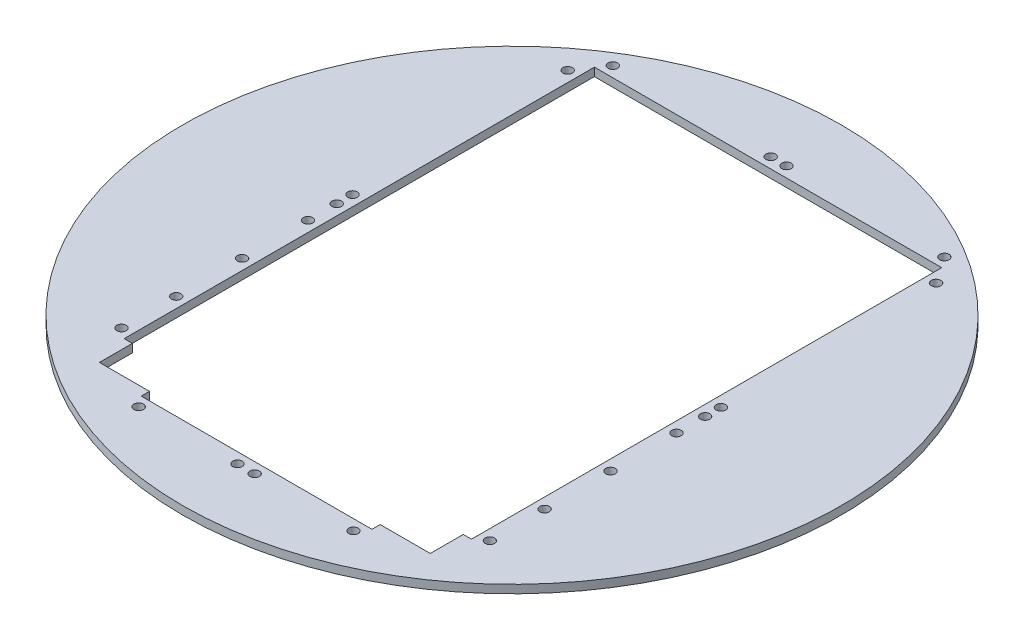
ISO-10303-21;
HEADER;
FILE_DESCRIPTION(('STEP AP214'),'2;1');
FILE_NAME('part.step','',(''),(''),'','','');
FILE_SCHEMA(('AUTOMOTIVE_DESIGN { 1 0 10303 214 1 1 1 1 }'));
ENDSEC;
DATA;
#1=APPLICATION_CONTEXT('core data for automotive mechanical design processes');
#2=APPLICATION_PROTOCOL_DEFINITION('international standard','automotive_design',2000,#1);
#3=PRODUCT_CONTEXT('',#1,'mechanical');
#4=PRODUCT('Part','Part','',(#3));
#5=PRODUCT_RELATED_PRODUCT_CATEGORY('part','',(#4));
#6=PRODUCT_DEFINITION_FORMATION('','',#4);
#7=PRODUCT_DEFINITION_CONTEXT('part definition',#1,'design');
#8=PRODUCT_DEFINITION('design','',#6,#7);
#9=PRODUCT_DEFINITION_SHAPE('','',#8);
#10=(LENGTH_UNIT() NAMED_UNIT(*) SI_UNIT(.MILLI.,.METRE.));
#11=(NAMED_UNIT(*) PLANE_ANGLE_UNIT() SI_UNIT($,.RADIAN.));
#12=(NAMED_UNIT(*) SI_UNIT($,.STERADIAN.) SOLID_ANGLE_UNIT());
#13=UNCERTAINTY_MEASURE_WITH_UNIT(LENGTH_MEASURE(1.E-05),#10,'distance_accuracy_value','');
#14=(GEOMETRIC_REPRESENTATION_CONTEXT(3) GLOBAL_UNCERTAINTY_ASSIGNED_CONTEXT((#13)) GLOBAL_UNIT_ASSIGNED_CONTEXT((#10,
#11,#12)) REPRESENTATION_CONTEXT('',''));
#15=CARTESIAN_POINT('',(0.,0.,0.));
#16=DIRECTION('',(0.,0.,1.));
#17=DIRECTION('',(1.,0.,0.));
#18=AXIS2_PLACEMENT_3D('',#15,#16,#17);
#19=CARTESIAN_POINT('',(63.5,0.,95.25));
#20=DIRECTION('',(0.,0.,1.));
#21=DIRECTION('',(1.,0.,0.));
#22=AXIS2_PLACEMENT_3D('',#19,#20,#21);
#23=PLANE('',#22);
#24=DIRECTION('',(1.,0.,0.));
#25=VECTOR('',#24,1.);
#26=CARTESIAN_POINT('',(63.5,0.,95.25));
#27=LINE('',#26,#25);
#28=CARTESIAN_POINT('',(44.4500000000001,0.,95.25));
#29=VERTEX_POINT('',#28);
#30=CARTESIAN_POINT('',(63.754,0.,95.25));
#31=VERTEX_POINT('',#30);
#32=EDGE_CURVE('E293',#29,#31,#27,.T.);
#33=ORIENTED_EDGE('',*,*,#32,.F.);
#34=DIRECTION('',(0.,-1.,0.));
#35=VECTOR('',#34,1.);
#36=CARTESIAN_POINT('',(44.4500000000001,3.175,95.25));
#37=LINE('',#36,#35);
#38=CARTESIAN_POINT('',(44.4500000000001,3.175,95.25));
#39=VERTEX_POINT('',#38);
#40=EDGE_CURVE('E259',#39,#29,#37,.T.);
#41=ORIENTED_EDGE('',*,*,#40,.F.);
#42=DIRECTION('',(1.,0.,0.));
#43=VECTOR('',#42,1.);
#44=CARTESIAN_POINT('',(63.5,3.175,95.25));
#45=LINE('',#44,#43);
#46=CARTESIAN_POINT('',(63.754,3.175,95.25));
#47=VERTEX_POINT('',#46);
#48=EDGE_CURVE('E289',#39,#47,#45,.T.);
#49=ORIENTED_EDGE('',*,*,#48,.T.);
#50=DIRECTION('',(0.,-1.,0.));
#51=VECTOR('',#50,1.);
#52=CARTESIAN_POINT('',(63.754,3.175,95.25));
#53=LINE('',#52,#51);
#54=EDGE_CURVE('E235',#47,#31,#53,.T.);
#55=ORIENTED_EDGE('',*,*,#54,.T.);
#56=EDGE_LOOP('',(#33,#41,#49,#55));
#57=FACE_BOUND('',#56,.T.);
#58=ADVANCED_FACE('F32',(#57),#23,.F.);
#59=CARTESIAN_POINT('',(0.,3.175,0.));
#60=DIRECTION('',(0.,-1.,0.));
#61=DIRECTION('',(0.,0.,-1.));
#62=AXIS2_PLACEMENT_3D('',#59,#60,#61);
#63=CYLINDRICAL_SURFACE('',#62,127.);
#64=CARTESIAN_POINT('',(0.,3.175,0.));
#65=DIRECTION('',(0.,1.,0.));
#66=DIRECTION('',(0.,0.,1.));
#67=AXIS2_PLACEMENT_3D('',#64,#65,#66);
#68=CIRCLE('',#67,127.);
#69=CARTESIAN_POINT('',(0.,3.175,127.));
#70=VERTEX_POINT('',#69);
#71=EDGE_CURVE('E11',#70,#70,#68,.T.);
#72=ORIENTED_EDGE('',*,*,#71,.F.);
#73=EDGE_LOOP('',(#72));
#74=FACE_BOUND('',#73,.T.);
#75=CARTESIAN_POINT('',(0.,0.,0.));
#76=DIRECTION('',(0.,1.,0.));
#77=DIRECTION('',(0.,0.,1.));
#78=AXIS2_PLACEMENT_3D('',#75,#76,#77);
#79=CIRCLE('',#78,127.);
#80=CARTESIAN_POINT('',(0.,0.,127.));
#81=VERTEX_POINT('',#80);
#82=EDGE_CURVE('E36',#81,#81,#79,.T.);
#83=ORIENTED_EDGE('',*,*,#82,.T.);
#84=EDGE_LOOP('',(#83));
#85=FACE_BOUND('',#84,.T.);
#86=ADVANCED_FACE('F34',(#74,#85),#63,.T.);
#87=CARTESIAN_POINT('',(0.,3.175,0.));
#88=DIRECTION('',(0.,1.,0.));
#89=DIRECTION('',(0.,0.,1.));
#90=AXIS2_PLACEMENT_3D('',#87,#88,#89);
#91=PLANE('',#90);
#92=CARTESIAN_POINT('',(70.993,3.175,33.02));
#93=DIRECTION('',(0.,-1.,0.));
#94=DIRECTION('',(0.,0.,1.));
#95=AXIS2_PLACEMENT_3D('',#92,#93,#94);
#96=CIRCLE('',#95,1.8288);
#97=CARTESIAN_POINT('',(70.993,3.175,34.8488));
#98=VERTEX_POINT('',#97);
#99=EDGE_CURVE('E798',#98,#98,#96,.T.);
#100=ORIENTED_EDGE('',*,*,#99,.T.);
#101=EDGE_LOOP('',(#100));
#102=FACE_BOUND('',#101,.T.);
#103=CARTESIAN_POINT('',(70.993,3.175,7.62000000000004));
#104=DIRECTION('',(0.,-1.,0.));
#105=DIRECTION('',(0.,0.,1.));
#106=AXIS2_PLACEMENT_3D('',#103,#104,#105);
#107=CIRCLE('',#106,1.8288);
#108=CARTESIAN_POINT('',(70.993,3.175,9.44880000000004));
#109=VERTEX_POINT('',#108);
#110=EDGE_CURVE('E802',#109,#109,#107,.T.);
#111=ORIENTED_EDGE('',*,*,#110,.T.);
#112=EDGE_LOOP('',(#111));
#113=FACE_BOUND('',#112,.T.);
#114=CARTESIAN_POINT('',(70.993,3.175,58.42));
#115=DIRECTION('',(0.,-1.,0.));
#116=DIRECTION('',(0.,0.,1.));
#117=AXIS2_PLACEMENT_3D('',#114,#115,#116);
#118=CIRCLE('',#117,1.8288);
#119=CARTESIAN_POINT('',(70.993,3.175,60.2488));
#120=VERTEX_POINT('',#119);
#121=EDGE_CURVE('E806',#120,#120,#118,.T.);
#122=ORIENTED_EDGE('',*,*,#121,.T.);
#123=EDGE_LOOP('',(#122));
#124=FACE_BOUND('',#123,.T.);
#125=CARTESIAN_POINT('',(-70.993,3.175,33.02));
#126=DIRECTION('',(0.,-1.,0.));
#127=DIRECTION('',(0.,0.,-1.));
#128=AXIS2_PLACEMENT_3D('',#125,#126,#127);
#129=CIRCLE('',#128,1.8288);
#130=CARTESIAN_POINT('',(-70.993,3.175,31.1912));
#131=VERTEX_POINT('',#130);
#132=EDGE_CURVE('E810',#131,#131,#129,.T.);
#133=ORIENTED_EDGE('',*,*,#132,.T.);
#134=EDGE_LOOP('',(#133));
#135=FACE_BOUND('',#134,.T.);
#136=CARTESIAN_POINT('',(-70.993,3.175,7.62000000000003));
#137=DIRECTION('',(0.,-1.,0.));
#138=DIRECTION('',(0.,0.,-1.));
#139=AXIS2_PLACEMENT_3D('',#136,#137,#138);
#140=CIRCLE('',#139,1.8288);
#141=CARTESIAN_POINT('',(-70.993,3.175,5.79120000000003));
#142=VERTEX_POINT('',#141);
#143=EDGE_CURVE('E814',#142,#142,#140,.T.);
#144=ORIENTED_EDGE('',*,*,#143,.T.);
#145=EDGE_LOOP('',(#144));
#146=FACE_BOUND('',#145,.T.);
#147=CARTESIAN_POINT('',(-70.993,3.175,58.42));
#148=DIRECTION('',(0.,-1.,0.));
#149=DIRECTION('',(0.,0.,-1.));
#150=AXIS2_PLACEMENT_3D('',#147,#148,#149);
#151=CIRCLE('',#150,1.8288);
#152=CARTESIAN_POINT('',(-70.993,3.175,56.5912));
#153=VERTEX_POINT('',#152);
#154=EDGE_CURVE('E818',#153,#153,#151,.T.);
#155=ORIENTED_EDGE('',*,*,#154,.T.);
#156=EDGE_LOOP('',(#155));
#157=FACE_BOUND('',#156,.T.);
#158=CARTESIAN_POINT('',(63.881,3.175,-102.743));
#159=DIRECTION('',(0.,-1.,0.));
#160=DIRECTION('',(0.,0.,1.));
#161=AXIS2_PLACEMENT_3D('',#158,#159,#160);
#162=CIRCLE('',#161,1.8288);
#163=CARTESIAN_POINT('',(63.881,3.175,-100.9142));
#164=VERTEX_POINT('',#163);
#165=EDGE_CURVE('E822',#164,#164,#162,.T.);
#166=ORIENTED_EDGE('',*,*,#165,.T.);
#167=EDGE_LOOP('',(#166));
#168=FACE_BOUND('',#167,.T.);
#169=CARTESIAN_POINT('',(3.048,3.175,-102.743));
#170=DIRECTION('',(0.,-1.,0.));
#171=DIRECTION('',(0.,0.,1.));
#172=AXIS2_PLACEMENT_3D('',#169,#170,#171);
#173=CIRCLE('',#172,1.8288);
#174=CARTESIAN_POINT('',(3.048,3.175,-100.9142));
#175=VERTEX_POINT('',#174);
#176=EDGE_CURVE('E826',#175,#175,#173,.T.);
#177=ORIENTED_EDGE('',*,*,#176,.T.);
#178=EDGE_LOOP('',(#177));
#179=FACE_BOUND('',#178,.T.);
#180=CARTESIAN_POINT('',(-3.048,3.175,-102.743));
#181=DIRECTION('',(0.,-1.,0.));
#182=DIRECTION('',(0.,0.,-1.));
#183=AXIS2_PLACEMENT_3D('',#180,#181,#182);
#184=CIRCLE('',#183,1.8288);
#185=CARTESIAN_POINT('',(-3.048,3.175,-104.5718));
#186=VERTEX_POINT('',#185);
#187=EDGE_CURVE('E830',#186,#186,#184,.T.);
#188=ORIENTED_EDGE('',*,*,#187,.T.);
#189=EDGE_LOOP('',(#188));
#190=FACE_BOUND('',#189,.T.);
#191=CARTESIAN_POINT('',(-63.881,3.175,-102.743));
#192=DIRECTION('',(0.,-1.,0.));
#193=DIRECTION('',(0.,0.,-1.));
#194=AXIS2_PLACEMENT_3D('',#191,#192,#193);
#195=CIRCLE('',#194,1.8288);
#196=CARTESIAN_POINT('',(-63.881,3.175,-104.5718));
#197=VERTEX_POINT('',#196);
#198=EDGE_CURVE('E147',#197,#197,#195,.T.);
#199=ORIENTED_EDGE('',*,*,#198,.T.);
#200=EDGE_LOOP('',(#199));
#201=FACE_BOUND('',#200,.T.);
#202=DIRECTION('',(0.,0.,-1.));
#203=VECTOR('',#202,1.);
#204=CARTESIAN_POINT('',(-66.929,3.175,-95.504));
#205=LINE('',#204,#203);
#206=CARTESIAN_POINT('',(-66.929,3.175,82.55));
#207=VERTEX_POINT('',#206);
#208=CARTESIAN_POINT('',(-66.929,3.175,-98.679));
#209=VERTEX_POINT('',#208);
#210=EDGE_CURVE('E121',#207,#209,#205,.T.);
#211=ORIENTED_EDGE('',*,*,#210,.T.);
#212=DIRECTION('',(1.,0.,0.));
#213=VECTOR('',#212,1.);
#214=CARTESIAN_POINT('',(-66.929,3.175,-98.679));
#215=LINE('',#214,#213);
#216=CARTESIAN_POINT('',(66.929,3.175,-98.679));
#217=VERTEX_POINT('',#216);
#218=EDGE_CURVE('E127',#209,#217,#215,.T.);
#219=ORIENTED_EDGE('',*,*,#218,.T.);
#220=DIRECTION('',(0.,0.,1.));
#221=VECTOR('',#220,1.);
#222=CARTESIAN_POINT('',(66.929,3.175,-95.504));
#223=LINE('',#222,#221);
#224=CARTESIAN_POINT('',(66.929,3.175,82.55));
#225=VERTEX_POINT('',#224);
#226=EDGE_CURVE('E203',#217,#225,#223,.T.);
#227=ORIENTED_EDGE('',*,*,#226,.T.);
#228=DIRECTION('',(-1.,0.,0.));
#229=VECTOR('',#228,1.);
#230=CARTESIAN_POINT('',(63.754,3.175,82.55));
#231=LINE('',#230,#229);
#232=CARTESIAN_POINT('',(63.754,3.175,82.55));
#233=VERTEX_POINT('',#232);
#234=EDGE_CURVE('E205',#225,#233,#231,.T.);
#235=ORIENTED_EDGE('',*,*,#234,.T.);
#236=DIRECTION('',(0.,0.,1.));
#237=VECTOR('',#236,1.);
#238=CARTESIAN_POINT('',(63.754,3.175,95.25));
#239=LINE('',#238,#237);
#240=EDGE_CURVE('E228',#233,#47,#239,.T.);
#241=ORIENTED_EDGE('',*,*,#240,.T.);
#242=ORIENTED_EDGE('',*,*,#48,.F.);
#243=DIRECTION('',(0.,0.,-1.));
#244=VECTOR('',#243,1.);
#245=CARTESIAN_POINT('',(44.4500000000001,3.175,95.25));
#246=LINE('',#245,#244);
#247=CARTESIAN_POINT('',(44.4500000000001,3.175,98.425));
#248=VERTEX_POINT('',#247);
#249=EDGE_CURVE('E253',#248,#39,#246,.T.);
#250=ORIENTED_EDGE('',*,*,#249,.F.);
#251=DIRECTION('',(-1.,0.,0.));
#252=VECTOR('',#251,1.);
#253=CARTESIAN_POINT('',(50.8000000000001,3.175,98.425));
#254=LINE('',#253,#252);
#255=CARTESIAN_POINT('',(-44.4499999999999,3.175,98.425));
#256=VERTEX_POINT('',#255);
#257=EDGE_CURVE('E55',#248,#256,#254,.T.);
#258=ORIENTED_EDGE('',*,*,#257,.T.);
#259=DIRECTION('',(0.,0.,1.));
#260=VECTOR('',#259,1.);
#261=CARTESIAN_POINT('',(-44.4499999999999,3.175,95.25));
#262=LINE('',#261,#260);
#263=CARTESIAN_POINT('',(-44.4499999999999,3.175,95.25));
#264=VERTEX_POINT('',#263);
#265=EDGE_CURVE('E264',#264,#256,#262,.T.);
#266=ORIENTED_EDGE('',*,*,#265,.F.);
#267=CARTESIAN_POINT('',(-63.754,3.175,95.25));
#268=VERTEX_POINT('',#267);
#269=EDGE_CURVE('E294',#268,#264,#45,.T.);
#270=ORIENTED_EDGE('',*,*,#269,.F.);
#271=DIRECTION('',(0.,0.,-1.));
#272=VECTOR('',#271,1.);
#273=CARTESIAN_POINT('',(-63.754,3.175,-95.504));
#274=LINE('',#273,#272);
#275=CARTESIAN_POINT('',(-63.754,3.175,82.55));
#276=VERTEX_POINT('',#275);
#277=EDGE_CURVE('E226',#268,#276,#274,.T.);
#278=ORIENTED_EDGE('',*,*,#277,.T.);
#279=DIRECTION('',(-1.,0.,0.));
#280=VECTOR('',#279,1.);
#281=CARTESIAN_POINT('',(-63.754,3.175,82.55));
#282=LINE('',#281,#280);
#283=EDGE_CURVE('E47',#276,#207,#282,.T.);
#284=ORIENTED_EDGE('',*,*,#283,.T.);
#285=EDGE_LOOP('',(#211,#219,#227,#235,#241,#242,#250,#258,#266,#270,#278,#284));
#286=FACE_BOUND('',#285,.T.);
#287=CARTESIAN_POINT('',(70.993,3.175,79.502));
#288=DIRECTION('',(0.,-1.,0.));
#289=DIRECTION('',(0.,0.,1.));
#290=AXIS2_PLACEMENT_3D('',#287,#288,#289);
#291=CIRCLE('',#290,1.8288);
#292=CARTESIAN_POINT('',(70.993,3.175,81.3308));
#293=VERTEX_POINT('',#292);
#294=EDGE_CURVE('E155',#293,#293,#291,.T.);
#295=ORIENTED_EDGE('',*,*,#294,.T.);
#296=EDGE_LOOP('',(#295));
#297=FACE_BOUND('',#296,.T.);
#298=CARTESIAN_POINT('',(70.993,3.175,-3.42899999999996));
#299=DIRECTION('',(0.,-1.,0.));
#300=DIRECTION('',(0.,0.,1.));
#301=AXIS2_PLACEMENT_3D('',#298,#299,#300);
#302=CIRCLE('',#301,1.8288);
#303=CARTESIAN_POINT('',(70.993,3.175,-1.60019999999996));
#304=VERTEX_POINT('',#303);
#305=EDGE_CURVE('E161',#304,#304,#302,.T.);
#306=ORIENTED_EDGE('',*,*,#305,.T.);
#307=EDGE_LOOP('',(#306));
#308=FACE_BOUND('',#307,.T.);
#309=CARTESIAN_POINT('',(70.993,3.175,-9.52499999999997));
#310=DIRECTION('',(0.,-1.,0.));
#311=DIRECTION('',(0.,0.,1.));
#312=AXIS2_PLACEMENT_3D('',#309,#310,#311);
#313=CIRCLE('',#312,1.8288);
#314=CARTESIAN_POINT('',(70.993,3.175,-7.69619999999998));
#315=VERTEX_POINT('',#314);
#316=EDGE_CURVE('E167',#315,#315,#313,.T.);
#317=ORIENTED_EDGE('',*,*,#316,.T.);
#318=EDGE_LOOP('',(#317));
#319=FACE_BOUND('',#318,.T.);
#320=CARTESIAN_POINT('',(70.9930000000001,3.175,-92.456));
#321=DIRECTION('',(0.,-1.,0.));
#322=DIRECTION('',(0.,0.,1.));
#323=AXIS2_PLACEMENT_3D('',#320,#321,#322);
#324=CIRCLE('',#323,1.8288);
#325=CARTESIAN_POINT('',(70.9930000000001,3.175,-90.6272));
#326=VERTEX_POINT('',#325);
#327=EDGE_CURVE('E173',#326,#326,#324,.T.);
#328=ORIENTED_EDGE('',*,*,#327,.T.);
#329=EDGE_LOOP('',(#328));
#330=FACE_BOUND('',#329,.T.);
#331=CARTESIAN_POINT('',(-70.993,3.175,-9.52499999999999));
#332=DIRECTION('',(0.,-1.,0.));
#333=DIRECTION('',(0.,0.,-1.));
#334=AXIS2_PLACEMENT_3D('',#331,#332,#333);
#335=CIRCLE('',#334,1.8288);
#336=CARTESIAN_POINT('',(-70.993,3.175,-11.3538));
#337=VERTEX_POINT('',#336);
#338=EDGE_CURVE('E179',#337,#337,#335,.T.);
#339=ORIENTED_EDGE('',*,*,#338,.T.);
#340=EDGE_LOOP('',(#339));
#341=FACE_BOUND('',#340,.T.);
#342=CARTESIAN_POINT('',(-70.993,3.175,-3.42899999999997));
#343=DIRECTION('',(0.,-1.,0.));
#344=DIRECTION('',(0.,0.,-1.));
#345=AXIS2_PLACEMENT_3D('',#342,#343,#344);
#346=CIRCLE('',#345,1.8288);
#347=CARTESIAN_POINT('',(-70.993,3.175,-5.25779999999997));
#348=VERTEX_POINT('',#347);
#349=EDGE_CURVE('E185',#348,#348,#346,.T.);
#350=ORIENTED_EDGE('',*,*,#349,.T.);
#351=EDGE_LOOP('',(#350));
#352=FACE_BOUND('',#351,.T.);
#353=CARTESIAN_POINT('',(-70.993,3.175,-92.456));
#354=DIRECTION('',(0.,-1.,0.));
#355=DIRECTION('',(0.,0.,-1.));
#356=AXIS2_PLACEMENT_3D('',#353,#354,#355);
#357=CIRCLE('',#356,1.8288);
#358=CARTESIAN_POINT('',(-70.993,3.175,-94.2848));
#359=VERTEX_POINT('',#358);
#360=EDGE_CURVE('E191',#359,#359,#357,.T.);
#361=ORIENTED_EDGE('',*,*,#360,.T.);
#362=EDGE_LOOP('',(#361));
#363=FACE_BOUND('',#362,.T.);
#364=CARTESIAN_POINT('',(-70.993,3.175,79.502));
#365=DIRECTION('',(0.,-1.,0.));
#366=DIRECTION('',(0.,0.,-1.));
#367=AXIS2_PLACEMENT_3D('',#364,#365,#366);
#368=CIRCLE('',#367,1.8288);
#369=CARTESIAN_POINT('',(-70.993,3.175,77.6732));
#370=VERTEX_POINT('',#369);
#371=EDGE_CURVE('E197',#370,#370,#368,.T.);
#372=ORIENTED_EDGE('',*,*,#371,.T.);
#373=EDGE_LOOP('',(#372));
#374=FACE_BOUND('',#373,.T.);
#375=CARTESIAN_POINT('',(41.4020000000001,3.175,102.489));
#376=DIRECTION('',(0.,-1.,0.));
#377=DIRECTION('',(0.,0.,-1.));
#378=AXIS2_PLACEMENT_3D('',#375,#376,#377);
#379=CIRCLE('',#378,1.8288);
#380=CARTESIAN_POINT('',(41.4020000000001,3.175,100.6602));
#381=VERTEX_POINT('',#380);
#382=EDGE_CURVE('E241',#381,#381,#379,.T.);
#383=ORIENTED_EDGE('',*,*,#382,.T.);
#384=EDGE_LOOP('',(#383));
#385=FACE_BOUND('',#384,.T.);
#386=CARTESIAN_POINT('',(-41.4019999999999,3.175,102.489));
#387=DIRECTION('',(0.,-1.,0.));
#388=DIRECTION('',(0.,0.,-1.));
#389=AXIS2_PLACEMENT_3D('',#386,#387,#388);
#390=CIRCLE('',#389,1.8288);
#391=CARTESIAN_POINT('',(-41.4019999999999,3.175,100.6602));
#392=VERTEX_POINT('',#391);
#393=EDGE_CURVE('E247',#392,#392,#390,.T.);
#394=ORIENTED_EDGE('',*,*,#393,.T.);
#395=EDGE_LOOP('',(#394));
#396=FACE_BOUND('',#395,.T.);
#397=CARTESIAN_POINT('',(3.302,3.175,102.489));
#398=DIRECTION('',(0.,-1.,0.));
#399=DIRECTION('',(0.,0.,1.));
#400=AXIS2_PLACEMENT_3D('',#397,#398,#399);
#401=CIRCLE('',#400,1.8288);
#402=CARTESIAN_POINT('',(3.302,3.175,104.3178));
#403=VERTEX_POINT('',#402);
#404=EDGE_CURVE('E276',#403,#403,#401,.T.);
#405=ORIENTED_EDGE('',*,*,#404,.T.);
#406=EDGE_LOOP('',(#405));
#407=FACE_BOUND('',#406,.T.);
#408=CARTESIAN_POINT('',(-3.302,3.175,102.489));
#409=DIRECTION('',(0.,-1.,0.));
#410=DIRECTION('',(0.,0.,-1.));
#411=AXIS2_PLACEMENT_3D('',#408,#409,#410);
#412=CIRCLE('',#411,1.82879999999999);
#413=CARTESIAN_POINT('',(-3.302,3.175,100.6602));
#414=VERTEX_POINT('',#413);
#415=EDGE_CURVE('E282',#414,#414,#412,.T.);
#416=ORIENTED_EDGE('',*,*,#415,.T.);
#417=EDGE_LOOP('',(#416));
#418=FACE_BOUND('',#417,.T.);
#419=ORIENTED_EDGE('',*,*,#71,.T.);
#420=EDGE_LOOP('',(#419));
#421=FACE_BOUND('',#420,.T.);
#422=ADVANCED_FACE('F123',(#102,#113,#124,#135,#146,#157,#168,#179,#190,#201,#286,#297,#308,
#319,#330,#341,#352,#363,#374,#385,#396,#407,#418,#421),#91,.T.);
#423=CARTESIAN_POINT('',(0.,0.,0.));
#424=DIRECTION('',(0.,1.,0.));
#425=DIRECTION('',(0.,0.,1.));
#426=AXIS2_PLACEMENT_3D('',#423,#424,#425);
#427=PLANE('',#426);
#428=CARTESIAN_POINT('',(70.993,0.,33.02));
#429=DIRECTION('',(0.,-1.,0.));
#430=DIRECTION('',(0.,0.,1.));
#431=AXIS2_PLACEMENT_3D('',#428,#429,#430);
#432=CIRCLE('',#431,1.8288);
#433=CARTESIAN_POINT('',(70.993,0.,34.8488));
#434=VERTEX_POINT('',#433);
#435=EDGE_CURVE('E365',#434,#434,#432,.T.);
#436=ORIENTED_EDGE('',*,*,#435,.F.);
#437=EDGE_LOOP('',(#436));
#438=FACE_BOUND('',#437,.T.);
#439=CARTESIAN_POINT('',(70.993,0.,7.62000000000004));
#440=DIRECTION('',(0.,-1.,0.));
#441=DIRECTION('',(0.,0.,1.));
#442=AXIS2_PLACEMENT_3D('',#439,#440,#441);
#443=CIRCLE('',#442,1.8288);
#444=CARTESIAN_POINT('',(70.993,0.,9.44880000000004));
#445=VERTEX_POINT('',#444);
#446=EDGE_CURVE('E369',#445,#445,#443,.T.);
#447=ORIENTED_EDGE('',*,*,#446,.F.);
#448=EDGE_LOOP('',(#447));
#449=FACE_BOUND('',#448,.T.);
#450=CARTESIAN_POINT('',(70.993,0.,58.42));
#451=DIRECTION('',(0.,-1.,0.));
#452=DIRECTION('',(0.,0.,1.));
#453=AXIS2_PLACEMENT_3D('',#450,#451,#452);
#454=CIRCLE('',#453,1.8288);
#455=CARTESIAN_POINT('',(70.993,0.,60.2488));
#456=VERTEX_POINT('',#455);
#457=EDGE_CURVE('E373',#456,#456,#454,.T.);
#458=ORIENTED_EDGE('',*,*,#457,.F.);
#459=EDGE_LOOP('',(#458));
#460=FACE_BOUND('',#459,.T.);
#461=CARTESIAN_POINT('',(-70.993,0.,33.02));
#462=DIRECTION('',(0.,-1.,0.));
#463=DIRECTION('',(0.,0.,-1.));
#464=AXIS2_PLACEMENT_3D('',#461,#462,#463);
#465=CIRCLE('',#464,1.8288);
#466=CARTESIAN_POINT('',(-70.993,0.,31.1912));
#467=VERTEX_POINT('',#466);
#468=EDGE_CURVE('E377',#467,#467,#465,.T.);
#469=ORIENTED_EDGE('',*,*,#468,.F.);
#470=EDGE_LOOP('',(#469));
#471=FACE_BOUND('',#470,.T.);
#472=CARTESIAN_POINT('',(-70.993,0.,7.62000000000003));
#473=DIRECTION('',(0.,-1.,0.));
#474=DIRECTION('',(0.,0.,-1.));
#475=AXIS2_PLACEMENT_3D('',#472,#473,#474);
#476=CIRCLE('',#475,1.8288);
#477=CARTESIAN_POINT('',(-70.993,0.,5.79120000000003));
#478=VERTEX_POINT('',#477);
#479=EDGE_CURVE('E381',#478,#478,#476,.T.);
#480=ORIENTED_EDGE('',*,*,#479,.F.);
#481=EDGE_LOOP('',(#480));
#482=FACE_BOUND('',#481,.T.);
#483=CARTESIAN_POINT('',(-70.993,0.,58.42));
#484=DIRECTION('',(0.,-1.,0.));
#485=DIRECTION('',(0.,0.,-1.));
#486=AXIS2_PLACEMENT_3D('',#483,#484,#485);
#487=CIRCLE('',#486,1.8288);
#488=CARTESIAN_POINT('',(-70.993,0.,56.5912));
#489=VERTEX_POINT('',#488);
#490=EDGE_CURVE('E385',#489,#489,#487,.T.);
#491=ORIENTED_EDGE('',*,*,#490,.F.);
#492=EDGE_LOOP('',(#491));
#493=FACE_BOUND('',#492,.T.);
#494=CARTESIAN_POINT('',(63.881,0.,-102.743));
#495=DIRECTION('',(0.,-1.,0.));
#496=DIRECTION('',(0.,0.,1.));
#497=AXIS2_PLACEMENT_3D('',#494,#495,#496);
#498=CIRCLE('',#497,1.8288);
#499=CARTESIAN_POINT('',(63.881,0.,-100.9142));
#500=VERTEX_POINT('',#499);
#501=EDGE_CURVE('E389',#500,#500,#498,.T.);
#502=ORIENTED_EDGE('',*,*,#501,.F.);
#503=EDGE_LOOP('',(#502));
#504=FACE_BOUND('',#503,.T.);
#505=CARTESIAN_POINT('',(3.048,0.,-102.743));
#506=DIRECTION('',(0.,-1.,0.));
#507=DIRECTION('',(0.,0.,1.));
#508=AXIS2_PLACEMENT_3D('',#505,#506,#507);
#509=CIRCLE('',#508,1.8288);
#510=CARTESIAN_POINT('',(3.048,0.,-100.9142));
#511=VERTEX_POINT('',#510);
#512=EDGE_CURVE('E393',#511,#511,#509,.T.);
#513=ORIENTED_EDGE('',*,*,#512,.F.);
#514=EDGE_LOOP('',(#513));
#515=FACE_BOUND('',#514,.T.);
#516=CARTESIAN_POINT('',(-3.048,0.,-102.743));
#517=DIRECTION('',(0.,-1.,0.));
#518=DIRECTION('',(0.,0.,-1.));
#519=AXIS2_PLACEMENT_3D('',#516,#517,#518);
#520=CIRCLE('',#519,1.8288);
#521=CARTESIAN_POINT('',(-3.048,0.,-104.5718));
#522=VERTEX_POINT('',#521);
#523=EDGE_CURVE('E397',#522,#522,#520,.T.);
#524=ORIENTED_EDGE('',*,*,#523,.F.);
#525=EDGE_LOOP('',(#524));
#526=FACE_BOUND('',#525,.T.);
#527=CARTESIAN_POINT('',(-63.881,0.,-102.743));
#528=DIRECTION('',(0.,-1.,0.));
#529=DIRECTION('',(0.,0.,-1.));
#530=AXIS2_PLACEMENT_3D('',#527,#528,#529);
#531=CIRCLE('',#530,1.8288);
#532=CARTESIAN_POINT('',(-63.881,0.,-104.5718));
#533=VERTEX_POINT('',#532);
#534=EDGE_CURVE('E150',#533,#533,#531,.T.);
#535=ORIENTED_EDGE('',*,*,#534,.F.);
#536=EDGE_LOOP('',(#535));
#537=FACE_BOUND('',#536,.T.);
#538=CARTESIAN_POINT('',(70.993,0.,79.502));
#539=DIRECTION('',(0.,-1.,0.));
#540=DIRECTION('',(0.,0.,1.));
#541=AXIS2_PLACEMENT_3D('',#538,#539,#540);
#542=CIRCLE('',#541,1.8288);
#543=CARTESIAN_POINT('',(70.993,0.,81.3308));
#544=VERTEX_POINT('',#543);
#545=EDGE_CURVE('E153',#544,#544,#542,.T.);
#546=ORIENTED_EDGE('',*,*,#545,.F.);
#547=EDGE_LOOP('',(#546));
#548=FACE_BOUND('',#547,.T.);
#549=CARTESIAN_POINT('',(70.993,0.,-3.42899999999996));
#550=DIRECTION('',(0.,-1.,0.));
#551=DIRECTION('',(0.,0.,1.));
#552=AXIS2_PLACEMENT_3D('',#549,#550,#551);
#553=CIRCLE('',#552,1.8288);
#554=CARTESIAN_POINT('',(70.993,0.,-1.60019999999996));
#555=VERTEX_POINT('',#554);
#556=EDGE_CURVE('E158',#555,#555,#553,.T.);
#557=ORIENTED_EDGE('',*,*,#556,.F.);
#558=EDGE_LOOP('',(#557));
#559=FACE_BOUND('',#558,.T.);
#560=CARTESIAN_POINT('',(70.993,0.,-9.52499999999997));
#561=DIRECTION('',(0.,-1.,0.));
#562=DIRECTION('',(0.,0.,1.));
#563=AXIS2_PLACEMENT_3D('',#560,#561,#562);
#564=CIRCLE('',#563,1.8288);
#565=CARTESIAN_POINT('',(70.993,0.,-7.69619999999998));
#566=VERTEX_POINT('',#565);
#567=EDGE_CURVE('E164',#566,#566,#564,.T.);
#568=ORIENTED_EDGE('',*,*,#567,.F.);
#569=EDGE_LOOP('',(#568));
#570=FACE_BOUND('',#569,.T.);
#571=CARTESIAN_POINT('',(70.9930000000001,0.,-92.456));
#572=DIRECTION('',(0.,-1.,0.));
#573=DIRECTION('',(0.,0.,1.));
#574=AXIS2_PLACEMENT_3D('',#571,#572,#573);
#575=CIRCLE('',#574,1.8288);
#576=CARTESIAN_POINT('',(70.9930000000001,0.,-90.6272));
#577=VERTEX_POINT('',#576);
#578=EDGE_CURVE('E170',#577,#577,#575,.T.);
#579=ORIENTED_EDGE('',*,*,#578,.F.);
#580=EDGE_LOOP('',(#579));
#581=FACE_BOUND('',#580,.T.);
#582=CARTESIAN_POINT('',(-70.993,0.,-9.52499999999999));
#583=DIRECTION('',(0.,-1.,0.));
#584=DIRECTION('',(0.,0.,-1.));
#585=AXIS2_PLACEMENT_3D('',#582,#583,#584);
#586=CIRCLE('',#585,1.8288);
#587=CARTESIAN_POINT('',(-70.993,0.,-11.3538));
#588=VERTEX_POINT('',#587);
#589=EDGE_CURVE('E176',#588,#588,#586,.T.);
#590=ORIENTED_EDGE('',*,*,#589,.F.);
#591=EDGE_LOOP('',(#590));
#592=FACE_BOUND('',#591,.T.);
#593=CARTESIAN_POINT('',(-70.993,0.,-3.42899999999997));
#594=DIRECTION('',(0.,-1.,0.));
#595=DIRECTION('',(0.,0.,-1.));
#596=AXIS2_PLACEMENT_3D('',#593,#594,#595);
#597=CIRCLE('',#596,1.8288);
#598=CARTESIAN_POINT('',(-70.993,0.,-5.25779999999997));
#599=VERTEX_POINT('',#598);
#600=EDGE_CURVE('E182',#599,#599,#597,.T.);
#601=ORIENTED_EDGE('',*,*,#600,.F.);
#602=EDGE_LOOP('',(#601));
#603=FACE_BOUND('',#602,.T.);
#604=CARTESIAN_POINT('',(-70.993,0.,-92.456));
#605=DIRECTION('',(0.,-1.,0.));
#606=DIRECTION('',(0.,0.,-1.));
#607=AXIS2_PLACEMENT_3D('',#604,#605,#606);
#608=CIRCLE('',#607,1.8288);
#609=CARTESIAN_POINT('',(-70.993,0.,-94.2848));
#610=VERTEX_POINT('',#609);
#611=EDGE_CURVE('E188',#610,#610,#608,.T.);
#612=ORIENTED_EDGE('',*,*,#611,.F.);
#613=EDGE_LOOP('',(#612));
#614=FACE_BOUND('',#613,.T.);
#615=CARTESIAN_POINT('',(-70.993,0.,79.502));
#616=DIRECTION('',(0.,-1.,0.));
#617=DIRECTION('',(0.,0.,-1.));
#618=AXIS2_PLACEMENT_3D('',#615,#616,#617);
#619=CIRCLE('',#618,1.8288);
#620=CARTESIAN_POINT('',(-70.993,0.,77.6732));
#621=VERTEX_POINT('',#620);
#622=EDGE_CURVE('E194',#621,#621,#619,.T.);
#623=ORIENTED_EDGE('',*,*,#622,.F.);
#624=EDGE_LOOP('',(#623));
#625=FACE_BOUND('',#624,.T.);
#626=CARTESIAN_POINT('',(41.4020000000001,0.,102.489));
#627=DIRECTION('',(0.,-1.,0.));
#628=DIRECTION('',(0.,0.,-1.));
#629=AXIS2_PLACEMENT_3D('',#626,#627,#628);
#630=CIRCLE('',#629,1.8288);
#631=CARTESIAN_POINT('',(41.4020000000001,0.,100.6602));
#632=VERTEX_POINT('',#631);
#633=EDGE_CURVE('E238',#632,#632,#630,.T.);
#634=ORIENTED_EDGE('',*,*,#633,.F.);
#635=EDGE_LOOP('',(#634));
#636=FACE_BOUND('',#635,.T.);
#637=CARTESIAN_POINT('',(-41.4019999999999,0.,102.489));
#638=DIRECTION('',(0.,-1.,0.));
#639=DIRECTION('',(0.,0.,-1.));
#640=AXIS2_PLACEMENT_3D('',#637,#638,#639);
#641=CIRCLE('',#640,1.8288);
#642=CARTESIAN_POINT('',(-41.4019999999999,0.,100.6602));
#643=VERTEX_POINT('',#642);
#644=EDGE_CURVE('E244',#643,#643,#641,.T.);
#645=ORIENTED_EDGE('',*,*,#644,.F.);
#646=EDGE_LOOP('',(#645));
#647=FACE_BOUND('',#646,.T.);
#648=DIRECTION('',(1.,0.,0.));
#649=VECTOR('',#648,1.);
#650=CARTESIAN_POINT('',(-66.929,0.,-98.679));
#651=LINE('',#650,#649);
#652=CARTESIAN_POINT('',(-66.929,0.,-98.679));
#653=VERTEX_POINT('',#652);
#654=CARTESIAN_POINT('',(66.929,0.,-98.679));
#655=VERTEX_POINT('',#654);
#656=EDGE_CURVE('E145',#653,#655,#651,.T.);
#657=ORIENTED_EDGE('',*,*,#656,.F.);
#658=DIRECTION('',(0.,0.,-1.));
#659=VECTOR('',#658,1.);
#660=CARTESIAN_POINT('',(-66.929,0.,-95.504));
#661=LINE('',#660,#659);
#662=CARTESIAN_POINT('',(-66.929,0.,82.55));
#663=VERTEX_POINT('',#662);
#664=EDGE_CURVE('E136',#663,#653,#661,.T.);
#665=ORIENTED_EDGE('',*,*,#664,.F.);
#666=DIRECTION('',(-1.,0.,0.));
#667=VECTOR('',#666,1.);
#668=CARTESIAN_POINT('',(-63.754,0.,82.55));
#669=LINE('',#668,#667);
#670=CARTESIAN_POINT('',(-63.754,0.,82.55));
#671=VERTEX_POINT('',#670);
#672=EDGE_CURVE('E216',#671,#663,#669,.T.);
#673=ORIENTED_EDGE('',*,*,#672,.F.);
#674=DIRECTION('',(0.,0.,-1.));
#675=VECTOR('',#674,1.);
#676=CARTESIAN_POINT('',(-63.754,0.,-95.504));
#677=LINE('',#676,#675);
#678=CARTESIAN_POINT('',(-63.754,0.,95.25));
#679=VERTEX_POINT('',#678);
#680=EDGE_CURVE('E224',#679,#671,#677,.T.);
#681=ORIENTED_EDGE('',*,*,#680,.F.);
#682=CARTESIAN_POINT('',(-44.4499999999999,0.,95.25));
#683=VERTEX_POINT('',#682);
#684=EDGE_CURVE('E291',#679,#683,#27,.T.);
#685=ORIENTED_EDGE('',*,*,#684,.T.);
#686=DIRECTION('',(0.,0.,1.));
#687=VECTOR('',#686,1.);
#688=CARTESIAN_POINT('',(-44.4499999999999,0.,95.25));
#689=LINE('',#688,#687);
#690=CARTESIAN_POINT('',(-44.4499999999999,0.,98.425));
#691=VERTEX_POINT('',#690);
#692=EDGE_CURVE('E262',#683,#691,#689,.T.);
#693=ORIENTED_EDGE('',*,*,#692,.T.);
#694=DIRECTION('',(-1.,0.,0.));
#695=VECTOR('',#694,1.);
#696=CARTESIAN_POINT('',(50.8000000000001,0.,98.425));
#697=LINE('',#696,#695);
#698=CARTESIAN_POINT('',(44.4500000000001,0.,98.425));
#699=VERTEX_POINT('',#698);
#700=EDGE_CURVE('E285',#699,#691,#697,.T.);
#701=ORIENTED_EDGE('',*,*,#700,.F.);
#702=DIRECTION('',(0.,0.,-1.));
#703=VECTOR('',#702,1.);
#704=CARTESIAN_POINT('',(44.4500000000001,0.,95.25));
#705=LINE('',#704,#703);
#706=EDGE_CURVE('E250',#699,#29,#705,.T.);
#707=ORIENTED_EDGE('',*,*,#706,.T.);
#708=ORIENTED_EDGE('',*,*,#32,.T.);
#709=DIRECTION('',(0.,0.,1.));
#710=VECTOR('',#709,1.);
#711=CARTESIAN_POINT('',(63.754,0.,95.25));
#712=LINE('',#711,#710);
#713=CARTESIAN_POINT('',(63.754,0.,82.55));
#714=VERTEX_POINT('',#713);
#715=EDGE_CURVE('E229',#714,#31,#712,.T.);
#716=ORIENTED_EDGE('',*,*,#715,.F.);
#717=DIRECTION('',(-1.,0.,0.));
#718=VECTOR('',#717,1.);
#719=CARTESIAN_POINT('',(63.754,0.,82.55));
#720=LINE('',#719,#718);
#721=CARTESIAN_POINT('',(66.929,0.,82.55));
#722=VERTEX_POINT('',#721);
#723=EDGE_CURVE('E206',#722,#714,#720,.T.);
#724=ORIENTED_EDGE('',*,*,#723,.F.);
#725=DIRECTION('',(0.,0.,1.));
#726=VECTOR('',#725,1.);
#727=CARTESIAN_POINT('',(66.929,0.,-95.504));
#728=LINE('',#727,#726);
#729=EDGE_CURVE('E200',#655,#722,#728,.T.);
#730=ORIENTED_EDGE('',*,*,#729,.F.);
#731=EDGE_LOOP('',(#657,#665,#673,#681,#685,#693,#701,#707,#708,#716,#724,#730));
#732=FACE_BOUND('',#731,.T.);
#733=CARTESIAN_POINT('',(3.302,0.,102.489));
#734=DIRECTION('',(0.,-1.,0.));
#735=DIRECTION('',(0.,0.,1.));
#736=AXIS2_PLACEMENT_3D('',#733,#734,#735);
#737=CIRCLE('',#736,1.8288);
#738=CARTESIAN_POINT('',(3.302,0.,104.3178));
#739=VERTEX_POINT('',#738);
#740=EDGE_CURVE('E273',#739,#739,#737,.T.);
#741=ORIENTED_EDGE('',*,*,#740,.F.);
#742=EDGE_LOOP('',(#741));
#743=FACE_BOUND('',#742,.T.);
#744=CARTESIAN_POINT('',(-3.302,0.,102.489));
#745=DIRECTION('',(0.,-1.,0.));
#746=DIRECTION('',(0.,0.,-1.));
#747=AXIS2_PLACEMENT_3D('',#744,#745,#746);
#748=CIRCLE('',#747,1.82879999999999);
#749=CARTESIAN_POINT('',(-3.302,0.,100.6602));
#750=VERTEX_POINT('',#749);
#751=EDGE_CURVE('E279',#750,#750,#748,.T.);
#752=ORIENTED_EDGE('',*,*,#751,.F.);
#753=EDGE_LOOP('',(#752));
#754=FACE_BOUND('',#753,.T.);
#755=ORIENTED_EDGE('',*,*,#82,.F.);
#756=EDGE_LOOP('',(#755));
#757=FACE_BOUND('',#756,.T.);
#758=ADVANCED_FACE('F310',(#438,#449,#460,#471,#482,#493,#504,#515,#526,#537,#548,#559,#570,
#581,#592,#603,#614,#625,#636,#647,#732,#743,#754,#757),#427,.F.);
#759=ORIENTED_EDGE('',*,*,#269,.T.);
#760=DIRECTION('',(0.,-1.,0.));
#761=VECTOR('',#760,1.);
#762=CARTESIAN_POINT('',(-44.4499999999999,3.175,95.25));
#763=LINE('',#762,#761);
#764=EDGE_CURVE('E267',#264,#683,#763,.T.);
#765=ORIENTED_EDGE('',*,*,#764,.T.);
#766=ORIENTED_EDGE('',*,*,#684,.F.);
#767=DIRECTION('',(0.,-1.,0.));
#768=VECTOR('',#767,1.);
#769=CARTESIAN_POINT('',(-63.754,3.175,95.25));
#770=LINE('',#769,#768);
#771=EDGE_CURVE('E231',#268,#679,#770,.T.);
#772=ORIENTED_EDGE('',*,*,#771,.F.);
#773=EDGE_LOOP('',(#759,#765,#766,#772));
#774=FACE_BOUND('',#773,.T.);
#775=ADVANCED_FACE('F321',(#774),#23,.F.);
#776=CARTESIAN_POINT('',(50.8000000000001,3.175,98.425));
#777=DIRECTION('',(0.,0.,1.));
#778=DIRECTION('',(1.,0.,0.));
#779=AXIS2_PLACEMENT_3D('',#776,#777,#778);
#780=PLANE('',#779);
#781=ORIENTED_EDGE('',*,*,#257,.F.);
#782=DIRECTION('',(0.,-1.,0.));
#783=VECTOR('',#782,1.);
#784=CARTESIAN_POINT('',(44.4500000000001,3.175,98.425));
#785=LINE('',#784,#783);
#786=EDGE_CURVE('E256',#248,#699,#785,.T.);
#787=ORIENTED_EDGE('',*,*,#786,.T.);
#788=ORIENTED_EDGE('',*,*,#700,.T.);
#789=DIRECTION('',(0.,-1.,0.));
#790=VECTOR('',#789,1.);
#791=CARTESIAN_POINT('',(-44.4499999999999,3.175,98.425));
#792=LINE('',#791,#790);
#793=EDGE_CURVE('E270',#256,#691,#792,.T.);
#794=ORIENTED_EDGE('',*,*,#793,.F.);
#795=EDGE_LOOP('',(#781,#787,#788,#794));
#796=FACE_BOUND('',#795,.T.);
#797=ADVANCED_FACE('F317',(#796),#780,.F.);
#798=CARTESIAN_POINT('',(-3.302,3.175,102.489));
#799=DIRECTION('',(0.,-1.,0.));
#800=DIRECTION('',(0.,0.,-1.));
#801=AXIS2_PLACEMENT_3D('',#798,#799,#800);
#802=CYLINDRICAL_SURFACE('',#801,1.82879999999999);
#803=ORIENTED_EDGE('',*,*,#415,.F.);
#804=EDGE_LOOP('',(#803));
#805=FACE_BOUND('',#804,.T.);
#806=ORIENTED_EDGE('',*,*,#751,.T.);
#807=EDGE_LOOP('',(#806));
#808=FACE_BOUND('',#807,.T.);
#809=ADVANCED_FACE('F354',(#805,#808),#802,.F.);
#810=CARTESIAN_POINT('',(3.302,3.175,102.489));
#811=DIRECTION('',(0.,-1.,0.));
#812=DIRECTION('',(0.,0.,-1.));
#813=AXIS2_PLACEMENT_3D('',#810,#811,#812);
#814=CYLINDRICAL_SURFACE('',#813,1.8288);
#815=ORIENTED_EDGE('',*,*,#404,.F.);
#816=EDGE_LOOP('',(#815));
#817=FACE_BOUND('',#816,.T.);
#818=ORIENTED_EDGE('',*,*,#740,.T.);
#819=EDGE_LOOP('',(#818));
#820=FACE_BOUND('',#819,.T.);
#821=ADVANCED_FACE('F437',(#817,#820),#814,.F.);
#822=CARTESIAN_POINT('',(-44.4499999999999,3.175,95.25));
#823=DIRECTION('',(1.,0.,0.));
#824=DIRECTION('',(0.,0.,-1.));
#825=AXIS2_PLACEMENT_3D('',#822,#823,#824);
#826=PLANE('',#825);
#827=ORIENTED_EDGE('',*,*,#692,.F.);
#828=ORIENTED_EDGE('',*,*,#764,.F.);
#829=ORIENTED_EDGE('',*,*,#265,.T.);
#830=ORIENTED_EDGE('',*,*,#793,.T.);
#831=EDGE_LOOP('',(#827,#828,#829,#830));
#832=FACE_BOUND('',#831,.T.);
#833=ADVANCED_FACE('F320',(#832),#826,.T.);
#834=CARTESIAN_POINT('',(44.4500000000001,3.175,95.25));
#835=DIRECTION('',(-1.,0.,0.));
#836=DIRECTION('',(0.,0.,1.));
#837=AXIS2_PLACEMENT_3D('',#834,#835,#836);
#838=PLANE('',#837);
#839=ORIENTED_EDGE('',*,*,#706,.F.);
#840=ORIENTED_EDGE('',*,*,#786,.F.);
#841=ORIENTED_EDGE('',*,*,#249,.T.);
#842=ORIENTED_EDGE('',*,*,#40,.T.);
#843=EDGE_LOOP('',(#839,#840,#841,#842));
#844=FACE_BOUND('',#843,.T.);
#845=ADVANCED_FACE('F315',(#844),#838,.T.);
#846=CARTESIAN_POINT('',(-41.4019999999999,3.175,102.489));
#847=DIRECTION('',(0.,-1.,0.));
#848=DIRECTION('',(0.,0.,-1.));
#849=AXIS2_PLACEMENT_3D('',#846,#847,#848);
#850=CYLINDRICAL_SURFACE('',#849,1.8288);
#851=ORIENTED_EDGE('',*,*,#393,.F.);
#852=EDGE_LOOP('',(#851));
#853=FACE_BOUND('',#852,.T.);
#854=ORIENTED_EDGE('',*,*,#644,.T.);
#855=EDGE_LOOP('',(#854));
#856=FACE_BOUND('',#855,.T.);
#857=ADVANCED_FACE('F421',(#853,#856),#850,.F.);
#858=CARTESIAN_POINT('',(41.4020000000001,3.175,102.489));
#859=DIRECTION('',(0.,-1.,0.));
#860=DIRECTION('',(0.,0.,-1.));
#861=AXIS2_PLACEMENT_3D('',#858,#859,#860);
#862=CYLINDRICAL_SURFACE('',#861,1.8288);
#863=ORIENTED_EDGE('',*,*,#382,.F.);
#864=EDGE_LOOP('',(#863));
#865=FACE_BOUND('',#864,.T.);
#866=ORIENTED_EDGE('',*,*,#633,.T.);
#867=EDGE_LOOP('',(#866));
#868=FACE_BOUND('',#867,.T.);
#869=ADVANCED_FACE('F423',(#865,#868),#862,.F.);
#870=CARTESIAN_POINT('',(63.754,3.175,95.25));
#871=DIRECTION('',(1.,0.,0.));
#872=DIRECTION('',(0.,0.,-1.));
#873=AXIS2_PLACEMENT_3D('',#870,#871,#872);
#874=PLANE('',#873);
#875=ORIENTED_EDGE('',*,*,#240,.F.);
#876=DIRECTION('',(0.,-1.,0.));
#877=VECTOR('',#876,1.);
#878=CARTESIAN_POINT('',(63.754,3.175,82.55));
#879=LINE('',#878,#877);
#880=EDGE_CURVE('E213',#233,#714,#879,.T.);
#881=ORIENTED_EDGE('',*,*,#880,.T.);
#882=ORIENTED_EDGE('',*,*,#715,.T.);
#883=ORIENTED_EDGE('',*,*,#54,.F.);
#884=EDGE_LOOP('',(#875,#881,#882,#883));
#885=FACE_BOUND('',#884,.T.);
#886=ADVANCED_FACE('F306',(#885),#874,.F.);
#887=CARTESIAN_POINT('',(-63.754,3.175,-95.504));
#888=DIRECTION('',(-1.,0.,0.));
#889=DIRECTION('',(0.,0.,1.));
#890=AXIS2_PLACEMENT_3D('',#887,#888,#889);
#891=PLANE('',#890);
#892=ORIENTED_EDGE('',*,*,#680,.T.);
#893=DIRECTION('',(0.,-1.,0.));
#894=VECTOR('',#893,1.);
#895=CARTESIAN_POINT('',(-63.754,3.175,82.55));
#896=LINE('',#895,#894);
#897=EDGE_CURVE('E130',#276,#671,#896,.T.);
#898=ORIENTED_EDGE('',*,*,#897,.F.);
#899=ORIENTED_EDGE('',*,*,#277,.F.);
#900=ORIENTED_EDGE('',*,*,#771,.T.);
#901=EDGE_LOOP('',(#892,#898,#899,#900));
#902=FACE_BOUND('',#901,.T.);
#903=ADVANCED_FACE('F325',(#902),#891,.F.);
#904=CARTESIAN_POINT('',(-66.929,3.175,-95.504));
#905=DIRECTION('',(-1.,0.,0.));
#906=DIRECTION('',(0.,0.,1.));
#907=AXIS2_PLACEMENT_3D('',#904,#905,#906);
#908=PLANE('',#907);
#909=ORIENTED_EDGE('',*,*,#664,.T.);
#910=DIRECTION('',(0.,-1.,0.));
#911=VECTOR('',#910,1.);
#912=CARTESIAN_POINT('',(-66.929,3.175,-98.679));
#913=LINE('',#912,#911);
#914=EDGE_CURVE('E133',#209,#653,#913,.T.);
#915=ORIENTED_EDGE('',*,*,#914,.F.);
#916=ORIENTED_EDGE('',*,*,#210,.F.);
#917=DIRECTION('',(0.,-1.,0.));
#918=VECTOR('',#917,1.);
#919=CARTESIAN_POINT('',(-66.929,3.175,82.55));
#920=LINE('',#919,#918);
#921=EDGE_CURVE('E222',#207,#663,#920,.T.);
#922=ORIENTED_EDGE('',*,*,#921,.T.);
#923=EDGE_LOOP('',(#909,#915,#916,#922));
#924=FACE_BOUND('',#923,.T.);
#925=ADVANCED_FACE('F134',(#924),#908,.F.);
#926=CARTESIAN_POINT('',(-63.754,3.175,82.55));
#927=DIRECTION('',(0.,0.,1.));
#928=DIRECTION('',(1.,0.,0.));
#929=AXIS2_PLACEMENT_3D('',#926,#927,#928);
#930=PLANE('',#929);
#931=ORIENTED_EDGE('',*,*,#672,.T.);
#932=ORIENTED_EDGE('',*,*,#921,.F.);
#933=ORIENTED_EDGE('',*,*,#283,.F.);
#934=ORIENTED_EDGE('',*,*,#897,.T.);
#935=EDGE_LOOP('',(#931,#932,#933,#934));
#936=FACE_BOUND('',#935,.T.);
#937=ADVANCED_FACE('F327',(#936),#930,.F.);
#938=CARTESIAN_POINT('',(63.754,3.175,82.55));
#939=DIRECTION('',(0.,0.,1.));
#940=DIRECTION('',(1.,0.,0.));
#941=AXIS2_PLACEMENT_3D('',#938,#939,#940);
#942=PLANE('',#941);
#943=ORIENTED_EDGE('',*,*,#723,.T.);
#944=ORIENTED_EDGE('',*,*,#880,.F.);
#945=ORIENTED_EDGE('',*,*,#234,.F.);
#946=DIRECTION('',(0.,-1.,0.));
#947=VECTOR('',#946,1.);
#948=CARTESIAN_POINT('',(66.929,3.175,82.55));
#949=LINE('',#948,#947);
#950=EDGE_CURVE('E209',#225,#722,#949,.T.);
#951=ORIENTED_EDGE('',*,*,#950,.T.);
#952=EDGE_LOOP('',(#943,#944,#945,#951));
#953=FACE_BOUND('',#952,.T.);
#954=ADVANCED_FACE('F329',(#953),#942,.F.);
#955=CARTESIAN_POINT('',(66.929,3.175,-95.504));
#956=DIRECTION('',(1.,0.,0.));
#957=DIRECTION('',(0.,0.,-1.));
#958=AXIS2_PLACEMENT_3D('',#955,#956,#957);
#959=PLANE('',#958);
#960=ORIENTED_EDGE('',*,*,#729,.T.);
#961=ORIENTED_EDGE('',*,*,#950,.F.);
#962=ORIENTED_EDGE('',*,*,#226,.F.);
#963=DIRECTION('',(0.,-1.,0.));
#964=VECTOR('',#963,1.);
#965=CARTESIAN_POINT('',(66.929,3.175,-98.679));
#966=LINE('',#965,#964);
#967=EDGE_CURVE('E140',#217,#655,#966,.T.);
#968=ORIENTED_EDGE('',*,*,#967,.T.);
#969=EDGE_LOOP('',(#960,#961,#962,#968));
#970=FACE_BOUND('',#969,.T.);
#971=ADVANCED_FACE('F335',(#970),#959,.F.);
#972=CARTESIAN_POINT('',(-70.993,3.175,79.502));
#973=DIRECTION('',(0.,-1.,0.));
#974=DIRECTION('',(0.,0.,-1.));
#975=AXIS2_PLACEMENT_3D('',#972,#973,#974);
#976=CYLINDRICAL_SURFACE('',#975,1.8288);
#977=ORIENTED_EDGE('',*,*,#371,.F.);
#978=EDGE_LOOP('',(#977));
#979=FACE_BOUND('',#978,.T.);
#980=ORIENTED_EDGE('',*,*,#622,.T.);
#981=EDGE_LOOP('',(#980));
#982=FACE_BOUND('',#981,.T.);
#983=ADVANCED_FACE('F520',(#979,#982),#976,.F.);
#984=CARTESIAN_POINT('',(-70.993,3.175,-92.456));
#985=DIRECTION('',(0.,-1.,0.));
#986=DIRECTION('',(0.,0.,-1.));
#987=AXIS2_PLACEMENT_3D('',#984,#985,#986);
#988=CYLINDRICAL_SURFACE('',#987,1.8288);
#989=ORIENTED_EDGE('',*,*,#360,.F.);
#990=EDGE_LOOP('',(#989));
#991=FACE_BOUND('',#990,.T.);
#992=ORIENTED_EDGE('',*,*,#611,.T.);
#993=EDGE_LOOP('',(#992));
#994=FACE_BOUND('',#993,.T.);
#995=ADVANCED_FACE('F525',(#991,#994),#988,.F.);
#996=CARTESIAN_POINT('',(-70.993,3.175,-3.42899999999997));
#997=DIRECTION('',(0.,-1.,0.));
#998=DIRECTION('',(0.,0.,-1.));
#999=AXIS2_PLACEMENT_3D('',#996,#997,#998);
#1000=CYLINDRICAL_SURFACE('',#999,1.8288);
#1001=ORIENTED_EDGE('',*,*,#349,.F.);
#1002=EDGE_LOOP('',(#1001));
#1003=FACE_BOUND('',#1002,.T.);
#1004=ORIENTED_EDGE('',*,*,#600,.T.);
#1005=EDGE_LOOP('',(#1004));
#1006=FACE_BOUND('',#1005,.T.);
#1007=ADVANCED_FACE('F535',(#1003,#1006),#1000,.F.);
#1008=CARTESIAN_POINT('',(-70.993,3.175,-9.52499999999999));
#1009=DIRECTION('',(0.,-1.,0.));
#1010=DIRECTION('',(0.,0.,-1.));
#1011=AXIS2_PLACEMENT_3D('',#1008,#1009,#1010);
#1012=CYLINDRICAL_SURFACE('',#1011,1.8288);
#1013=ORIENTED_EDGE('',*,*,#338,.F.);
#1014=EDGE_LOOP('',(#1013));
#1015=FACE_BOUND('',#1014,.T.);
#1016=ORIENTED_EDGE('',*,*,#589,.T.);
#1017=EDGE_LOOP('',(#1016));
#1018=FACE_BOUND('',#1017,.T.);
#1019=ADVANCED_FACE('F545',(#1015,#1018),#1012,.F.);
#1020=CARTESIAN_POINT('',(70.9930000000001,3.175,-92.456));
#1021=DIRECTION('',(0.,-1.,0.));
#1022=DIRECTION('',(0.,0.,-1.));
#1023=AXIS2_PLACEMENT_3D('',#1020,#1021,#1022);
#1024=CYLINDRICAL_SURFACE('',#1023,1.8288);
#1025=ORIENTED_EDGE('',*,*,#327,.F.);
#1026=EDGE_LOOP('',(#1025));
#1027=FACE_BOUND('',#1026,.T.);
#1028=ORIENTED_EDGE('',*,*,#578,.T.);
#1029=EDGE_LOOP('',(#1028));
#1030=FACE_BOUND('',#1029,.T.);
#1031=ADVANCED_FACE('F555',(#1027,#1030),#1024,.F.);
#1032=CARTESIAN_POINT('',(70.993,3.175,-9.52499999999997));
#1033=DIRECTION('',(0.,-1.,0.));
#1034=DIRECTION('',(0.,0.,-1.));
#1035=AXIS2_PLACEMENT_3D('',#1032,#1033,#1034);
#1036=CYLINDRICAL_SURFACE('',#1035,1.8288);
#1037=ORIENTED_EDGE('',*,*,#316,.F.);
#1038=EDGE_LOOP('',(#1037));
#1039=FACE_BOUND('',#1038,.T.);
#1040=ORIENTED_EDGE('',*,*,#567,.T.);
#1041=EDGE_LOOP('',(#1040));
#1042=FACE_BOUND('',#1041,.T.);
#1043=ADVANCED_FACE('F565',(#1039,#1042),#1036,.F.);
#1044=CARTESIAN_POINT('',(70.993,3.175,-3.42899999999996));
#1045=DIRECTION('',(0.,-1.,0.));
#1046=DIRECTION('',(0.,0.,-1.));
#1047=AXIS2_PLACEMENT_3D('',#1044,#1045,#1046);
#1048=CYLINDRICAL_SURFACE('',#1047,1.8288);
#1049=ORIENTED_EDGE('',*,*,#305,.F.);
#1050=EDGE_LOOP('',(#1049));
#1051=FACE_BOUND('',#1050,.T.);
#1052=ORIENTED_EDGE('',*,*,#556,.T.);
#1053=EDGE_LOOP('',(#1052));
#1054=FACE_BOUND('',#1053,.T.);
#1055=ADVANCED_FACE('F575',(#1051,#1054),#1048,.F.);
#1056=CARTESIAN_POINT('',(70.993,3.175,79.502));
#1057=DIRECTION('',(0.,-1.,0.));
#1058=DIRECTION('',(0.,0.,-1.));
#1059=AXIS2_PLACEMENT_3D('',#1056,#1057,#1058);
#1060=CYLINDRICAL_SURFACE('',#1059,1.8288);
#1061=ORIENTED_EDGE('',*,*,#294,.F.);
#1062=EDGE_LOOP('',(#1061));
#1063=FACE_BOUND('',#1062,.T.);
#1064=ORIENTED_EDGE('',*,*,#545,.T.);
#1065=EDGE_LOOP('',(#1064));
#1066=FACE_BOUND('',#1065,.T.);
#1067=ADVANCED_FACE('F585',(#1063,#1066),#1060,.F.);
#1068=CARTESIAN_POINT('',(-66.929,3.175,-98.679));
#1069=DIRECTION('',(0.,0.,-1.));
#1070=DIRECTION('',(-1.,0.,0.));
#1071=AXIS2_PLACEMENT_3D('',#1068,#1069,#1070);
#1072=PLANE('',#1071);
#1073=ORIENTED_EDGE('',*,*,#656,.T.);
#1074=ORIENTED_EDGE('',*,*,#967,.F.);
#1075=ORIENTED_EDGE('',*,*,#218,.F.);
#1076=ORIENTED_EDGE('',*,*,#914,.T.);
#1077=EDGE_LOOP('',(#1073,#1074,#1075,#1076));
#1078=FACE_BOUND('',#1077,.T.);
#1079=ADVANCED_FACE('F143',(#1078),#1072,.F.);
#1080=CARTESIAN_POINT('',(-63.881,3.175,-102.743));
#1081=DIRECTION('',(0.,-1.,0.));
#1082=DIRECTION('',(0.,0.,-1.));
#1083=AXIS2_PLACEMENT_3D('',#1080,#1081,#1082);
#1084=CYLINDRICAL_SURFACE('',#1083,1.8288);
#1085=ORIENTED_EDGE('',*,*,#198,.F.);
#1086=EDGE_LOOP('',(#1085));
#1087=FACE_BOUND('',#1086,.T.);
#1088=ORIENTED_EDGE('',*,*,#534,.T.);
#1089=EDGE_LOOP('',(#1088));
#1090=FACE_BOUND('',#1089,.T.);
#1091=ADVANCED_FACE('F618',(#1087,#1090),#1084,.F.);
#1092=CARTESIAN_POINT('',(-3.048,3.175,-102.743));
#1093=DIRECTION('',(0.,-1.,0.));
#1094=DIRECTION('',(0.,0.,-1.));
#1095=AXIS2_PLACEMENT_3D('',#1092,#1093,#1094);
#1096=CYLINDRICAL_SURFACE('',#1095,1.8288);
#1097=ORIENTED_EDGE('',*,*,#187,.F.);
#1098=EDGE_LOOP('',(#1097));
#1099=FACE_BOUND('',#1098,.T.);
#1100=ORIENTED_EDGE('',*,*,#523,.T.);
#1101=EDGE_LOOP('',(#1100));
#1102=FACE_BOUND('',#1101,.T.);
#1103=ADVANCED_FACE('F627',(#1099,#1102),#1096,.F.);
#1104=CARTESIAN_POINT('',(3.048,3.175,-102.743));
#1105=DIRECTION('',(0.,-1.,0.));
#1106=DIRECTION('',(0.,0.,-1.));
#1107=AXIS2_PLACEMENT_3D('',#1104,#1105,#1106);
#1108=CYLINDRICAL_SURFACE('',#1107,1.8288);
#1109=ORIENTED_EDGE('',*,*,#176,.F.);
#1110=EDGE_LOOP('',(#1109));
#1111=FACE_BOUND('',#1110,.T.);
#1112=ORIENTED_EDGE('',*,*,#512,.T.);
#1113=EDGE_LOOP('',(#1112));
#1114=FACE_BOUND('',#1113,.T.);
#1115=ADVANCED_FACE('F637',(#1111,#1114),#1108,.F.);
#1116=CARTESIAN_POINT('',(63.881,3.175,-102.743));
#1117=DIRECTION('',(0.,-1.,0.));
#1118=DIRECTION('',(0.,0.,-1.));
#1119=AXIS2_PLACEMENT_3D('',#1116,#1117,#1118);
#1120=CYLINDRICAL_SURFACE('',#1119,1.8288);
#1121=ORIENTED_EDGE('',*,*,#165,.F.);
#1122=EDGE_LOOP('',(#1121));
#1123=FACE_BOUND('',#1122,.T.);
#1124=ORIENTED_EDGE('',*,*,#501,.T.);
#1125=EDGE_LOOP('',(#1124));
#1126=FACE_BOUND('',#1125,.T.);
#1127=ADVANCED_FACE('F647',(#1123,#1126),#1120,.F.);
#1128=CARTESIAN_POINT('',(-70.993,3.175,58.42));
#1129=DIRECTION('',(0.,-1.,0.));
#1130=DIRECTION('',(0.,0.,-1.));
#1131=AXIS2_PLACEMENT_3D('',#1128,#1129,#1130);
#1132=CYLINDRICAL_SURFACE('',#1131,1.8288);
#1133=ORIENTED_EDGE('',*,*,#154,.F.);
#1134=EDGE_LOOP('',(#1133));
#1135=FACE_BOUND('',#1134,.T.);
#1136=ORIENTED_EDGE('',*,*,#490,.T.);
#1137=EDGE_LOOP('',(#1136));
#1138=FACE_BOUND('',#1137,.T.);
#1139=ADVANCED_FACE('F656',(#1135,#1138),#1132,.F.);
#1140=CARTESIAN_POINT('',(-70.993,3.175,7.62000000000003));
#1141=DIRECTION('',(0.,-1.,0.));
#1142=DIRECTION('',(0.,0.,-1.));
#1143=AXIS2_PLACEMENT_3D('',#1140,#1141,#1142);
#1144=CYLINDRICAL_SURFACE('',#1143,1.8288);
#1145=ORIENTED_EDGE('',*,*,#143,.F.);
#1146=EDGE_LOOP('',(#1145));
#1147=FACE_BOUND('',#1146,.T.);
#1148=ORIENTED_EDGE('',*,*,#479,.T.);
#1149=EDGE_LOOP('',(#1148));
#1150=FACE_BOUND('',#1149,.T.);
#1151=ADVANCED_FACE('F741',(#1147,#1150),#1144,.F.);
#1152=CARTESIAN_POINT('',(-70.993,3.175,33.02));
#1153=DIRECTION('',(0.,-1.,0.));
#1154=DIRECTION('',(0.,0.,-1.));
#1155=AXIS2_PLACEMENT_3D('',#1152,#1153,#1154);
#1156=CYLINDRICAL_SURFACE('',#1155,1.8288);
#1157=ORIENTED_EDGE('',*,*,#132,.F.);
#1158=EDGE_LOOP('',(#1157));
#1159=FACE_BOUND('',#1158,.T.);
#1160=ORIENTED_EDGE('',*,*,#468,.T.);
#1161=EDGE_LOOP('',(#1160));
#1162=FACE_BOUND('',#1161,.T.);
#1163=ADVANCED_FACE('F748',(#1159,#1162),#1156,.F.);
#1164=CARTESIAN_POINT('',(70.993,3.175,58.42));
#1165=DIRECTION('',(0.,-1.,0.));
#1166=DIRECTION('',(0.,0.,-1.));
#1167=AXIS2_PLACEMENT_3D('',#1164,#1165,#1166);
#1168=CYLINDRICAL_SURFACE('',#1167,1.8288);
#1169=ORIENTED_EDGE('',*,*,#121,.F.);
#1170=EDGE_LOOP('',(#1169));
#1171=FACE_BOUND('',#1170,.T.);
#1172=ORIENTED_EDGE('',*,*,#457,.T.);
#1173=EDGE_LOOP('',(#1172));
#1174=FACE_BOUND('',#1173,.T.);
#1175=ADVANCED_FACE('F756',(#1171,#1174),#1168,.F.);
#1176=CARTESIAN_POINT('',(70.993,3.175,7.62000000000004));
#1177=DIRECTION('',(0.,-1.,0.));
#1178=DIRECTION('',(0.,0.,-1.));
#1179=AXIS2_PLACEMENT_3D('',#1176,#1177,#1178);
#1180=CYLINDRICAL_SURFACE('',#1179,1.8288);
#1181=ORIENTED_EDGE('',*,*,#110,.F.);
#1182=EDGE_LOOP('',(#1181));
#1183=FACE_BOUND('',#1182,.T.);
#1184=ORIENTED_EDGE('',*,*,#446,.T.);
#1185=EDGE_LOOP('',(#1184));
#1186=FACE_BOUND('',#1185,.T.);
#1187=ADVANCED_FACE('F764',(#1183,#1186),#1180,.F.);
#1188=CARTESIAN_POINT('',(70.993,3.175,33.02));
#1189=DIRECTION('',(0.,-1.,0.));
#1190=DIRECTION('',(0.,0.,-1.));
#1191=AXIS2_PLACEMENT_3D('',#1188,#1189,#1190);
#1192=CYLINDRICAL_SURFACE('',#1191,1.8288);
#1193=ORIENTED_EDGE('',*,*,#99,.F.);
#1194=EDGE_LOOP('',(#1193));
#1195=FACE_BOUND('',#1194,.T.);
#1196=ORIENTED_EDGE('',*,*,#435,.T.);
#1197=EDGE_LOOP('',(#1196));
#1198=FACE_BOUND('',#1197,.T.);
#1199=ADVANCED_FACE('F772',(#1195,#1198),#1192,.F.);
#1200=CLOSED_SHELL('',(#58,#86,#422,#758,#775,#797,#809,#821,#833,#845,#857,#869,#886,#903,#925,
#937,#954,#971,#983,#995,#1007,#1019,#1031,#1043,#1055,#1067,#1079,#1091,#1103,#1115,#1127,
#1139,#1151,#1163,#1175,#1187,#1199));
#1201=MANIFOLD_SOLID_BREP('B2',#1200);
#1202=ADVANCED_BREP_SHAPE_REPRESENTATION('',(#18,#1201),#14);
#1203=SHAPE_DEFINITION_REPRESENTATION(#9,#1202);
ENDSEC;
END-ISO-10303-21;
